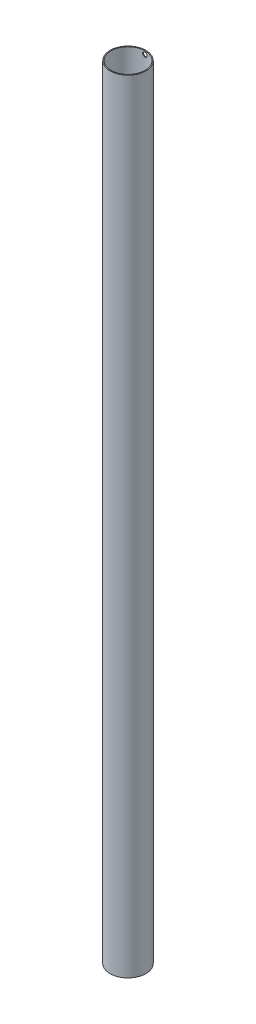
ISO-10303-21;
HEADER;
FILE_DESCRIPTION(('STEP AP214'),'2;1');
FILE_NAME('part.step','',(''),(''),'','','');
FILE_SCHEMA(('AUTOMOTIVE_DESIGN { 1 0 10303 214 1 1 1 1 }'));
ENDSEC;
DATA;
#1=APPLICATION_CONTEXT('core data for automotive mechanical design processes');
#2=APPLICATION_PROTOCOL_DEFINITION('international standard','automotive_design',2000,#1);
#3=PRODUCT_CONTEXT('',#1,'mechanical');
#4=PRODUCT('Part','Part','',(#3));
#5=PRODUCT_RELATED_PRODUCT_CATEGORY('part','',(#4));
#6=PRODUCT_DEFINITION_FORMATION('','',#4);
#7=PRODUCT_DEFINITION_CONTEXT('part definition',#1,'design');
#8=PRODUCT_DEFINITION('design','',#6,#7);
#9=PRODUCT_DEFINITION_SHAPE('','',#8);
#10=(LENGTH_UNIT() NAMED_UNIT(*) SI_UNIT(.MILLI.,.METRE.));
#11=(NAMED_UNIT(*) PLANE_ANGLE_UNIT() SI_UNIT($,.RADIAN.));
#12=(NAMED_UNIT(*) SI_UNIT($,.STERADIAN.) SOLID_ANGLE_UNIT());
#13=UNCERTAINTY_MEASURE_WITH_UNIT(LENGTH_MEASURE(1.E-05),#10,'distance_accuracy_value','');
#14=(GEOMETRIC_REPRESENTATION_CONTEXT(3) GLOBAL_UNCERTAINTY_ASSIGNED_CONTEXT((#13)) GLOBAL_UNIT_ASSIGNED_CONTEXT((#10,
#11,#12)) REPRESENTATION_CONTEXT('',''));
#15=CARTESIAN_POINT('',(0.,0.,0.));
#16=DIRECTION('',(0.,0.,1.));
#17=DIRECTION('',(1.,0.,0.));
#18=AXIS2_PLACEMENT_3D('',#15,#16,#17);
#19=CARTESIAN_POINT('',(0.,1750.,0.));
#20=DIRECTION('',(0.,1.,0.));
#21=DIRECTION('',(0.,0.,1.));
#22=AXIS2_PLACEMENT_3D('',#19,#20,#21);
#23=PLANE('',#22);
#24=CARTESIAN_POINT('',(0.,1750.,0.));
#25=DIRECTION('',(0.,1.,0.));
#26=DIRECTION('',(0.,0.,1.));
#27=AXIS2_PLACEMENT_3D('',#24,#25,#26);
#28=CIRCLE('',#27,40.);
#29=CARTESIAN_POINT('',(0.,1750.,40.));
#30=VERTEX_POINT('',#29);
#31=EDGE_CURVE('E10',#30,#30,#28,.T.);
#32=ORIENTED_EDGE('',*,*,#31,.T.);
#33=EDGE_LOOP('',(#32));
#34=FACE_BOUND('',#33,.T.);
#35=CARTESIAN_POINT('',(0.,1750.,0.));
#36=DIRECTION('',(0.,1.,0.));
#37=DIRECTION('',(0.,0.,1.));
#38=AXIS2_PLACEMENT_3D('',#35,#36,#37);
#39=CIRCLE('',#38,38.);
#40=CARTESIAN_POINT('',(0.,1750.,38.));
#41=VERTEX_POINT('',#40);
#42=EDGE_CURVE('E49',#41,#41,#39,.T.);
#43=ORIENTED_EDGE('',*,*,#42,.F.);
#44=EDGE_LOOP('',(#43));
#45=FACE_BOUND('',#44,.T.);
#46=ADVANCED_FACE('F31',(#34,#45),#23,.T.);
#47=CARTESIAN_POINT('',(0.,0.,0.));
#48=DIRECTION('',(0.,1.,0.));
#49=DIRECTION('',(0.,0.,1.));
#50=AXIS2_PLACEMENT_3D('',#47,#48,#49);
#51=PLANE('',#50);
#52=CARTESIAN_POINT('',(0.,0.,0.));
#53=DIRECTION('',(0.,1.,0.));
#54=DIRECTION('',(0.,0.,1.));
#55=AXIS2_PLACEMENT_3D('',#52,#53,#54);
#56=CIRCLE('',#55,40.);
#57=CARTESIAN_POINT('',(0.,0.,40.));
#58=VERTEX_POINT('',#57);
#59=EDGE_CURVE('E44',#58,#58,#56,.T.);
#60=ORIENTED_EDGE('',*,*,#59,.F.);
#61=EDGE_LOOP('',(#60));
#62=FACE_BOUND('',#61,.T.);
#63=CARTESIAN_POINT('',(0.,0.,0.));
#64=DIRECTION('',(0.,1.,0.));
#65=DIRECTION('',(0.,0.,1.));
#66=AXIS2_PLACEMENT_3D('',#63,#64,#65);
#67=CIRCLE('',#66,38.);
#68=CARTESIAN_POINT('',(0.,0.,38.));
#69=VERTEX_POINT('',#68);
#70=EDGE_CURVE('E51',#69,#69,#67,.T.);
#71=ORIENTED_EDGE('',*,*,#70,.T.);
#72=EDGE_LOOP('',(#71));
#73=FACE_BOUND('',#72,.T.);
#74=ADVANCED_FACE('F71',(#62,#73),#51,.F.);
#75=CARTESIAN_POINT('',(0.,1750.,0.));
#76=DIRECTION('',(0.,-1.,0.));
#77=DIRECTION('',(0.,0.,-1.));
#78=AXIS2_PLACEMENT_3D('',#75,#76,#77);
#79=CYLINDRICAL_SURFACE('',#78,40.);
#80=CARTESIAN_POINT('',(0.,1747.5,-40.));
#81=CARTESIAN_POINT('',(-0.139890119905133,1747.50000160544,-40.0000005381638));
#82=CARTESIAN_POINT('',(-0.279756672055427,1747.49412713053,-39.9992647084955));
#83=CARTESIAN_POINT('',(-0.558534146473246,1747.47067434773,-39.9963430990474));
#84=CARTESIAN_POINT('',(-0.697444844924129,1747.45309338704,-39.9941569906199));
#85=CARTESIAN_POINT('',(-0.973374569297794,1747.40633674356,-39.9883933720996));
#86=CARTESIAN_POINT('',(-1.11039210784,1747.37715242705,-39.984814825974));
#87=CARTESIAN_POINT('',(-1.3815095487987,1747.30739331014,-39.9763659190365));
#88=CARTESIAN_POINT('',(-1.51560836311208,1747.26681433761,-39.9714950850908));
#89=CARTESIAN_POINT('',(-1.77974867952934,1747.17461680295,-39.9606049872555));
#90=CARTESIAN_POINT('',(-1.90979428479132,1747.12300985009,-39.954586931772));
#91=CARTESIAN_POINT('',(-2.16511159371563,1747.00908421885,-39.9415653040234));
#92=CARTESIAN_POINT('',(-2.29038151829063,1746.94676159529,-39.9345613689602));
#93=CARTESIAN_POINT('',(-2.535157466937,1746.81190117409,-39.9197695937799));
#94=CARTESIAN_POINT('',(-2.65466661068786,1746.73936899069,-39.9119821851605));
#95=CARTESIAN_POINT('',(-2.88721115185143,1746.58454780778,-39.8958344174102));
#96=CARTESIAN_POINT('',(-3.00024412947128,1746.50225519615,-39.8874738466497));
#97=CARTESIAN_POINT('',(-3.21950680684037,1746.328115082,-39.870376541653));
#98=CARTESIAN_POINT('',(-3.32570323025805,1746.23622582935,-39.8616382696722));
#99=CARTESIAN_POINT('',(-3.53002741979655,1746.04381244367,-39.8440638930874));
#100=CARTESIAN_POINT('',(-3.62815218732704,1745.94328512973,-39.8352277534966));
#101=CARTESIAN_POINT('',(-3.81557488779224,1745.73435870872,-39.8177127277211));
#102=CARTESIAN_POINT('',(-3.9048756071177,1745.62596210543,-39.8090337926071));
#103=CARTESIAN_POINT('',(-4.07409000497663,1745.40198180306,-39.7920724042628));
#104=CARTESIAN_POINT('',(-4.15400020829436,1745.28639546727,-39.7837900984836));
#105=CARTESIAN_POINT('',(-4.30405460761979,1745.04851867461,-39.767836590115));
#106=CARTESIAN_POINT('',(-4.37416871629255,1744.92620910453,-39.7601672998988));
#107=CARTESIAN_POINT('',(-4.50386359810229,1744.6760232049,-39.7456849515384));
#108=CARTESIAN_POINT('',(-4.56344045265632,1744.54814482636,-39.7388722121988));
#109=CARTESIAN_POINT('',(-4.67157237881492,1744.28780851208,-39.7263059358327));
#110=CARTESIAN_POINT('',(-4.72013184632192,1744.15535242722,-39.7205519765303));
#111=CARTESIAN_POINT('',(-4.80591459607026,1743.88675855093,-39.7102634489657));
#112=CARTESIAN_POINT('',(-4.8431337151316,1743.75061942733,-39.7057293285926));
#113=CARTESIAN_POINT('',(-4.93694468367959,1743.3396702752,-39.6942156965831));
#114=CARTESIAN_POINT('',(-4.97637915708477,1743.06066399024,-39.689242054193));
#115=CARTESIAN_POINT('',(-5.00788537091911,1742.50010496912,-39.6852781774936));
#116=CARTESIAN_POINT('',(-4.99995901599062,1742.21855233582,-39.6862877025679));
#117=CARTESIAN_POINT('',(-4.9372306806791,1741.66240163939,-39.6941397412189));
#118=CARTESIAN_POINT('',(-4.88269650974369,1741.3877730541,-39.7009489290566));
#119=CARTESIAN_POINT('',(-4.7287017826105,1740.851606931,-39.7195838252991));
#120=CARTESIAN_POINT('',(-4.62924031615999,1740.59006965855,-39.7314096353432));
#121=CARTESIAN_POINT('',(-4.38793084641348,1740.08666481622,-39.7587823629902));
#122=CARTESIAN_POINT('',(-4.24596643413685,1739.84485361774,-39.7743394764765));
#123=CARTESIAN_POINT('',(-3.92376301219546,1739.38838639293,-39.8074142163638));
#124=CARTESIAN_POINT('',(-3.74352225186021,1739.17373160939,-39.8249319324209));
#125=CARTESIAN_POINT('',(-3.34839820167261,1738.77611463762,-39.8601022011236));
#126=CARTESIAN_POINT('',(-3.13328401036461,1738.59338183229,-39.8777548486259));
#127=CARTESIAN_POINT('',(-2.67531434354312,1738.26658222412,-39.911092650229));
#128=CARTESIAN_POINT('',(-2.43245880406289,1738.12251551044,-39.9267777997928));
#129=CARTESIAN_POINT('',(-1.92572334129984,1737.87713736329,-39.954423044609));
#130=CARTESIAN_POINT('',(-1.66183639028533,1737.77584029329,-39.9663818880919));
#131=CARTESIAN_POINT('',(-1.120615881252,1737.6190590119,-39.9852157155401));
#132=CARTESIAN_POINT('',(-0.843282953394262,1737.56357265574,-39.9920909375101));
#133=CARTESIAN_POINT('',(-0.28502632769475,1737.50028515146,-39.9999519282224));
#134=CARTESIAN_POINT('',(-0.00413898025510944,1737.49216801417,-40.0009767228211));
#135=CARTESIAN_POINT('',(0.554992072853036,1737.52301546921,-39.9971267601402));
#136=CARTESIAN_POINT('',(0.833235834693541,1737.5619790589,-39.9922521284979));
#137=CARTESIAN_POINT('',(1.37824901587756,1737.68561941317,-39.9771753750007));
#138=CARTESIAN_POINT('',(1.64505314244345,1737.77014551042,-39.9669908157769));
#139=CARTESIAN_POINT('',(2.16069930812288,1737.98235492022,-39.9424344625044));
#140=CARTESIAN_POINT('',(2.40954073698902,1738.11003969816,-39.9280625262813));
#141=CARTESIAN_POINT('',(2.88360904734714,1738.40570621352,-39.8966364563238));
#142=CARTESIAN_POINT('',(3.10870754222787,1738.57389234956,-39.8795688738227));
#143=CARTESIAN_POINT('',(3.52759395691152,1738.94549922513,-39.8447028535409));
#144=CARTESIAN_POINT('',(3.72138063328024,1739.14892136328,-39.8269043867709));
#145=CARTESIAN_POINT('',(4.07326400150423,1739.58661396985,-39.7924620828694));
#146=CARTESIAN_POINT('',(4.23115123496741,1739.82105346081,-39.775825395705));
#147=CARTESIAN_POINT('',(4.5053054650617,1740.31331972146,-39.7457083194625));
#148=CARTESIAN_POINT('',(4.62157329603301,1740.57114602218,-39.7322278671136));
#149=CARTESIAN_POINT('',(4.80885432607941,1741.10213860676,-39.7099966403349));
#150=CARTESIAN_POINT('',(4.87998560998225,1741.37526281197,-39.7012335337283));
#151=CARTESIAN_POINT('',(4.97533563287034,1741.9298498136,-39.6893996880528));
#152=CARTESIAN_POINT('',(4.99955655425281,1742.2113122215,-39.686328684172));
#153=CARTESIAN_POINT('',(5.00021203982538,1742.63229490032,-39.686241386048));
#154=CARTESIAN_POINT('',(4.9945534244889,1742.77200922555,-39.68695676783));
#155=CARTESIAN_POINT('',(4.97156759842694,1743.05044550454,-39.6898435691377));
#156=CARTESIAN_POINT('',(4.9542447344073,1743.18916780852,-39.6920144462689));
#157=CARTESIAN_POINT('',(4.90804527126815,1743.46468703838,-39.6977533828976));
#158=CARTESIAN_POINT('',(4.87916447008385,1743.60148324525,-39.7013219505368));
#159=CARTESIAN_POINT('',(4.81007786270752,1743.87209372374,-39.7097514776595));
#160=CARTESIAN_POINT('',(4.76987617588936,1744.00590906095,-39.7146119670106));
#161=CARTESIAN_POINT('',(4.67843682035615,1744.26966440411,-39.7254873627674));
#162=CARTESIAN_POINT('',(4.62719918212904,1744.39960442077,-39.731502265984));
#163=CARTESIAN_POINT('',(4.51407883701018,1744.65465706308,-39.7445132115212));
#164=CARTESIAN_POINT('',(4.45219999438851,1744.77977142101,-39.7515088975085));
#165=CARTESIAN_POINT('',(4.31820085845317,1745.02440060789,-39.766288286481));
#166=CARTESIAN_POINT('',(4.24607681362526,1745.14391336428,-39.7740722778211));
#167=CARTESIAN_POINT('',(4.09214062508206,1745.37642448291,-39.7902044420044));
#168=CARTESIAN_POINT('',(4.01033196639711,1745.4894251669,-39.7985524114375));
#169=CARTESIAN_POINT('',(3.83696646630918,1745.70895432041,-39.8156417227916));
#170=CARTESIAN_POINT('',(3.74534501263967,1745.81543158787,-39.8243854215878));
#171=CARTESIAN_POINT('',(3.55351080059102,1746.02026178004,-39.8419606965952));
#172=CARTESIAN_POINT('',(3.45330116889794,1746.1186176361,-39.8507922397986));
#173=CARTESIAN_POINT('',(3.24489676777323,1746.3066193573,-39.8683029909287));
#174=CARTESIAN_POINT('',(3.13669721323733,1746.39625992724,-39.8769821036513));
#175=CARTESIAN_POINT('',(2.91316118457674,1746.56610237103,-39.8939349862932));
#176=CARTESIAN_POINT('',(2.79782736151186,1746.64630771919,-39.9022089047575));
#177=CARTESIAN_POINT('',(2.56029300186387,1746.79706521534,-39.9181553288822));
#178=CARTESIAN_POINT('',(2.43806574742498,1746.86757555883,-39.925825172646));
#179=CARTESIAN_POINT('',(2.18809688735176,1746.99801067552,-39.9403041894309));
#180=CARTESIAN_POINT('',(2.06035732624471,1747.05793933221,-39.9471136779408));
#181=CARTESIAN_POINT('',(1.80032528471162,1747.16676281986,-39.9596765836336));
#182=CARTESIAN_POINT('',(1.66803644956573,1747.21566625823,-39.9654308239915));
#183=CARTESIAN_POINT('',(1.39980201837414,1747.30212587716,-39.9757248289655));
#184=CARTESIAN_POINT('',(1.26385729314409,1747.33968473433,-39.9802648800246));
#185=CARTESIAN_POINT('',(0.942088347754073,1747.41409048578,-39.9893293227844));
#186=CARTESIAN_POINT('',(0.75515089775798,1747.44627339192,-39.993314089932));
#187=CARTESIAN_POINT('',(0.378794555992385,1747.4892269834,-39.9986490545576));
#188=CARTESIAN_POINT('',(0.189375682531509,1747.49999782664,-39.999999271463));
#189=CARTESIAN_POINT('',(0.,1747.5,-40.));
#190=B_SPLINE_CURVE_WITH_KNOTS('',3,(#80,#81,#82,#83,#84,#85,#86,#87,#88,#89,#90,#91,#92,#93,
#94,#95,#96,#97,#98,#99,#100,#101,#102,#103,#104,#105,#106,#107,#108,#109,#110,#111,#112,#113,
#114,#115,#116,#117,#118,#119,#120,#121,#122,#123,#124,#125,#126,#127,#128,#129,#130,#131,#132,
#133,#134,#135,#136,#137,#138,#139,#140,#141,#142,#143,#144,#145,#146,#147,#148,#149,#150,#151,
#152,#153,#154,#155,#156,#157,#158,#159,#160,#161,#162,#163,#164,#165,#166,#167,#168,#169,#170,
#171,#172,#173,#174,#175,#176,#177,#178,#179,#180,#181,#182,#183,#184,#185,#186,#187,#188,#189),
.UNSPECIFIED.,.T.,.F.,(4,2,2,2,2,2,2,2,2,2,2,2,2,2,2,2,2,2,2,2,2,2,2,2,2,2,2,2,2,2,2,2,2,2,2,2,
2,2,2,2,2,2,2,2,2,2,2,2,2,2,2,2,2,2,4),(0.,0.41950463782401,0.839104372080601,1.2590169051986,
1.6790833898206,2.09870982539674,2.51849108679862,2.93804240646991,3.35774948092477,
3.77936522319634,4.2011368933698,4.62277495120624,5.04456855951603,5.46763043530075,
5.89084930960155,6.31389902278669,6.73710385606694,7.57817257185709,8.41920746382375,
9.25544199496442,10.0916934694555,10.9302565918415,11.7688580764037,12.6132576288592,
13.4576591283931,14.3023439807631,15.1469892842065,15.9859936539693,16.8249801561694,
17.6612091439987,18.4974665277097,19.3380361246992,20.1786390936325,21.0240274962821,
21.8693989505617,22.7125495517494,23.5556609263434,23.9747450940194,24.3936731755016,
24.812753703262,25.2316819351986,25.6506090098182,26.0693842743661,26.4883132802116,
26.9070919891522,27.3288208308202,27.7503967812446,28.1722272905916,28.5939019805888,
29.0173414250532,29.4406251425126,29.8635772481612,30.2864294856976,30.8543363757694,
31.4222390780256),.UNSPECIFIED.);
#191=CARTESIAN_POINT('',(0.,1747.5,-40.));
#192=VERTEX_POINT('',#191);
#193=EDGE_CURVE('E54',#192,#192,#190,.T.);
#194=ORIENTED_EDGE('',*,*,#193,.T.);
#195=EDGE_LOOP('',(#194));
#196=FACE_BOUND('',#195,.T.);
#197=ORIENTED_EDGE('',*,*,#31,.F.);
#198=EDGE_LOOP('',(#197));
#199=FACE_BOUND('',#198,.T.);
#200=ORIENTED_EDGE('',*,*,#59,.T.);
#201=EDGE_LOOP('',(#200));
#202=FACE_BOUND('',#201,.T.);
#203=ADVANCED_FACE('F33',(#196,#199,#202),#79,.T.);
#204=CARTESIAN_POINT('',(0.,1750.,0.));
#205=DIRECTION('',(0.,-1.,0.));
#206=DIRECTION('',(0.,0.,-1.));
#207=AXIS2_PLACEMENT_3D('',#204,#205,#206);
#208=CYLINDRICAL_SURFACE('',#207,38.);
#209=CARTESIAN_POINT('',(0.,1747.5,-38.));
#210=CARTESIAN_POINT('',(-0.139827173805465,1747.50000167664,-38.0000005893026));
#211=CARTESIAN_POINT('',(-0.279630016313879,1747.49413245128,-37.9992267173652));
#212=CARTESIAN_POINT('',(-0.558279630526736,1747.47070108578,-37.9961541121181));
#213=CARTESIAN_POINT('',(-0.697126182359507,1747.45313634168,-37.9938550392284));
#214=CARTESIAN_POINT('',(-0.972924997236437,1747.4064239463,-37.9877935944839));
#215=CARTESIAN_POINT('',(-1.10987580424902,1747.37726785321,-37.9840301561964));
#216=CARTESIAN_POINT('',(-1.38086014256225,1747.3075777545,-37.9751446316185));
#217=CARTESIAN_POINT('',(-1.51489258562322,1747.2670395803,-37.9700220475914));
#218=CARTESIAN_POINT('',(-1.77889894378765,1747.17493782817,-37.9585689927767));
#219=CARTESIAN_POINT('',(-1.90887704354739,1747.12338608052,-37.9522398188338));
#220=CARTESIAN_POINT('',(-2.16406291646772,1747.00958496316,-37.9385446025055));
#221=CARTESIAN_POINT('',(-2.28926891172171,1746.94733165313,-37.9311781783862));
#222=CARTESIAN_POINT('',(-2.53392399395277,1746.81262326685,-37.9156201073643));
#223=CARTESIAN_POINT('',(-2.65337615566702,1746.74017372231,-37.9074289086031));
#224=CARTESIAN_POINT('',(-2.88581550274296,1746.58553079888,-37.8904428014647));
#225=CARTESIAN_POINT('',(-2.99880027008965,1746.50333381047,-37.881647669959));
#226=CARTESIAN_POINT('',(-3.21803398665954,1746.32935233936,-37.8636556310254));
#227=CARTESIAN_POINT('',(-3.32424596833086,1746.23752145793,-37.8544569161359));
#228=CARTESIAN_POINT('',(-3.52860722654728,1746.04522548895,-37.8359546502843));
#229=CARTESIAN_POINT('',(-3.62675350623373,1745.94475722024,-37.8266510618027));
#230=CARTESIAN_POINT('',(-3.81422663813821,1745.73594742023,-37.8082074001644));
#231=CARTESIAN_POINT('',(-3.90355625998728,1745.62760838011,-37.7990672764009));
#232=CARTESIAN_POINT('',(-4.07283640194845,1745.40373973665,-37.7812023718806));
#233=CARTESIAN_POINT('',(-4.15278344996801,1745.28820749548,-37.7724777455869));
#234=CARTESIAN_POINT('',(-4.3029481602993,1745.0503881206,-37.7556666975462));
#235=CARTESIAN_POINT('',(-4.37313195013267,1744.92807943233,-37.7475825376149));
#236=CARTESIAN_POINT('',(-4.50296535964819,1744.67788371913,-37.7323147632565));
#237=CARTESIAN_POINT('',(-4.56261105820435,1744.54999463976,-37.7251314843262));
#238=CARTESIAN_POINT('',(-4.67087786610236,1744.2896254322,-37.7118798720486));
#239=CARTESIAN_POINT('',(-4.71950340775972,1744.15714717459,-37.7058110906366));
#240=CARTESIAN_POINT('',(-4.80541377180915,1743.88849770759,-37.6949578225796));
#241=CARTESIAN_POINT('',(-4.84269443263189,1743.75232516295,-37.6901738072924));
#242=CARTESIAN_POINT('',(-4.93664447396984,1743.3414142654,-37.6780272917609));
#243=CARTESIAN_POINT('',(-4.97617270941504,1743.06247079926,-37.6727752187155));
#244=CARTESIAN_POINT('',(-5.00788229226824,1742.50201632495,-37.6685722997963));
#245=CARTESIAN_POINT('',(-5.00006574277392,1742.22050543137,-37.6696211740287));
#246=CARTESIAN_POINT('',(-4.9375909584646,1741.66460309123,-37.6778604000332));
#247=CARTESIAN_POINT('',(-4.88322993513618,1741.39017782884,-37.6850117830345));
#248=CARTESIAN_POINT('',(-4.72965675506353,1740.85438944971,-37.7045923385047));
#249=CARTESIAN_POINT('',(-4.63044360019046,1740.59302662379,-37.7170216284264));
#250=CARTESIAN_POINT('',(-4.38966990811322,1740.08985014382,-37.7458006881754));
#251=CARTESIAN_POINT('',(-4.24798098799493,1739.84809862018,-37.7621623133203));
#252=CARTESIAN_POINT('',(-3.92636834211414,1739.39169191918,-37.7969537024261));
#253=CARTESIAN_POINT('',(-3.74644267979293,1739.1770381151,-37.8153835711141));
#254=CARTESIAN_POINT('',(-3.35182053722462,1738.77919415728,-37.8524078607452));
#255=CARTESIAN_POINT('',(-3.13686796025035,1738.59625794608,-37.8710024596344));
#256=CARTESIAN_POINT('',(-2.67917318315239,1738.26902230348,-37.9061290870926));
#257=CARTESIAN_POINT('',(-2.43643090658588,1738.12472297838,-37.9226611099877));
#258=CARTESIAN_POINT('',(-1.92984551315677,1737.87885383047,-37.9518117394229));
#259=CARTESIAN_POINT('',(-1.66599414487115,1737.77730081503,-37.9644288061348));
#260=CARTESIAN_POINT('',(-1.12478066285468,1737.62001331207,-37.9843142775397));
#261=CARTESIAN_POINT('',(-0.847419251231571,1737.56427644621,-37.991582959869));
#262=CARTESIAN_POINT('',(-0.289253683058114,1737.50053463065,-37.9999164272303));
#263=CARTESIAN_POINT('',(-0.0084901078173431,1737.49218003491,-38.0010266557481));
#264=CARTESIAN_POINT('',(0.550433330392632,1737.52251588641,-37.9970410666863));
#265=CARTESIAN_POINT('',(0.828593254792765,1737.56120522085,-37.9919453959034));
#266=CARTESIAN_POINT('',(1.37337501872894,1737.68424011369,-37.9761488039321));
#267=CARTESIAN_POINT('',(1.64003535958208,1737.76841806149,-37.9654684650592));
#268=CARTESIAN_POINT('',(2.15545537965893,1737.97986587883,-37.9396976968612));
#269=CARTESIAN_POINT('',(2.40421439151408,1738.10713735391,-37.9246071032261));
#270=CARTESIAN_POINT('',(2.87832607700339,1738.40199880811,-37.8915835745992));
#271=CARTESIAN_POINT('',(3.10353764526371,1738.56981388556,-37.8736349685475));
#272=CARTESIAN_POINT('',(3.52272363700334,1738.94068269835,-37.8369499021587));
#273=CARTESIAN_POINT('',(3.71669668027535,1739.14373798988,-37.8182134070565));
#274=CARTESIAN_POINT('',(4.06914818554975,1739.58086378683,-37.7819229822575));
#275=CARTESIAN_POINT('',(4.2273942178392,1739.81512246491,-37.7643772880799));
#276=CARTESIAN_POINT('',(4.50229017676511,1740.30711058989,-37.7325935813094));
#277=CARTESIAN_POINT('',(4.61894101206686,1740.56483952392,-37.7183554964625));
#278=CARTESIAN_POINT('',(4.80696796654004,1741.09566346201,-37.6948544852316));
#279=CARTESIAN_POINT('',(4.87847296497428,1741.36871227969,-37.6855774082079));
#280=CARTESIAN_POINT('',(4.97457363010994,1741.92322659482,-37.6730151539828));
#281=CARTESIAN_POINT('',(4.99917173505585,1742.20469165402,-37.6697296653359));
#282=CARTESIAN_POINT('',(5.00038176018792,1742.62561777222,-37.669564080716));
#283=CARTESIAN_POINT('',(4.99491445651593,1742.76524947141,-37.670292361017));
#284=CARTESIAN_POINT('',(4.97232515631454,1743.04353636364,-37.6732815818125));
#285=CARTESIAN_POINT('',(4.95520750616166,1743.18219190136,-37.6755419507316));
#286=CARTESIAN_POINT('',(4.9094315430938,1743.45759358416,-37.6815340047253));
#287=CARTESIAN_POINT('',(4.8807690429303,1743.59433901782,-37.6852662236207));
#288=CARTESIAN_POINT('',(4.81213126355231,1743.864864848,-37.694092248381));
#289=CARTESIAN_POINT('',(4.77216009295074,1743.99864630237,-37.699185559703));
#290=CARTESIAN_POINT('',(4.68119726346453,1744.26234046421,-37.7105885726492));
#291=CARTESIAN_POINT('',(4.6302065846919,1744.39225351457,-37.7168981660879));
#292=CARTESIAN_POINT('',(4.51759240818444,1744.6472728919,-37.7305522453723));
#293=CARTESIAN_POINT('',(4.4559727629252,1744.77238094042,-37.7378963560804));
#294=CARTESIAN_POINT('',(4.3225026043145,1745.01702092511,-37.753416855033));
#295=CARTESIAN_POINT('',(4.25064830507753,1745.13655077604,-37.7615935509374));
#296=CARTESIAN_POINT('',(4.09725980949826,1745.36912176353,-37.7785443236699));
#297=CARTESIAN_POINT('',(4.01572908421857,1745.48216520539,-37.7873181858077));
#298=CARTESIAN_POINT('',(3.84286410538492,1745.70188801618,-37.8052906690916));
#299=CARTESIAN_POINT('',(3.7514585930902,1745.8085111043,-37.8144920611676));
#300=CARTESIAN_POINT('',(3.56004562076108,1746.01365175899,-37.8329924055036));
#301=CARTESIAN_POINT('',(3.46004128490217,1746.11217224422,-37.8422913212616));
#302=CARTESIAN_POINT('',(3.25203426117363,1746.3005223988,-37.860733993901));
#303=CARTESIAN_POINT('',(3.14402678963051,1746.39034679508,-37.8698776539031));
#304=CARTESIAN_POINT('',(2.92085825384995,1746.56057575591,-37.8877435430019));
#305=CARTESIAN_POINT('',(2.8056998468709,1746.64098378787,-37.8964659265265));
#306=CARTESIAN_POINT('',(2.56844918034762,1746.79219607755,-37.913286233068));
#307=CARTESIAN_POINT('',(2.44632751443664,1746.86295454908,-37.9213811053095));
#308=CARTESIAN_POINT('',(2.19654300832747,1746.99389327116,-37.9366689178239));
#309=CARTESIAN_POINT('',(2.0688822235266,1747.05407740437,-37.9438621888649));
#310=CARTESIAN_POINT('',(1.80897816432049,1747.16341676862,-37.9571404325894));
#311=CARTESIAN_POINT('',(1.67673850157943,1747.21258047329,-37.9632262561096));
#312=CARTESIAN_POINT('',(1.40857438553234,1747.29956147194,-37.974121896062));
#313=CARTESIAN_POINT('',(1.27265079863292,1747.33738140898,-37.9789320097015));
#314=CARTESIAN_POINT('',(0.949506875428191,1747.41272031554,-37.9885896005996));
#315=CARTESIAN_POINT('',(0.76112357122173,1747.44541581682,-37.992850321283));
#316=CARTESIAN_POINT('',(0.381811715662992,1747.4890544222,-37.9985551067751));
#317=CARTESIAN_POINT('',(0.190883185955593,1747.49999771115,-37.9999991955215));
#318=CARTESIAN_POINT('',(0.,1747.5,-38.));
#319=B_SPLINE_CURVE_WITH_KNOTS('',3,(#209,#210,#211,#212,#213,#214,#215,#216,#217,#218,#219,
#220,#221,#222,#223,#224,#225,#226,#227,#228,#229,#230,#231,#232,#233,#234,#235,#236,#237,#238,
#239,#240,#241,#242,#243,#244,#245,#246,#247,#248,#249,#250,#251,#252,#253,#254,#255,#256,#257,
#258,#259,#260,#261,#262,#263,#264,#265,#266,#267,#268,#269,#270,#271,#272,#273,#274,#275,#276,
#277,#278,#279,#280,#281,#282,#283,#284,#285,#286,#287,#288,#289,#290,#291,#292,#293,#294,#295,
#296,#297,#298,#299,#300,#301,#302,#303,#304,#305,#306,#307,#308,#309,#310,#311,#312,#313,#314,
#315,#316,#317,#318),.UNSPECIFIED.,.T.,.F.,(4,2,2,2,2,2,2,2,2,2,2,2,2,2,2,2,2,2,2,2,2,2,2,2,2,2,
2,2,2,2,2,2,2,2,2,2,2,2,2,2,2,2,2,2,2,2,2,2,2,2,2,2,2,2,4),(0.,0.419314443962592,
0.838722277957316,1.25843612155173,1.67830388242657,2.09772288737555,2.51729665432953,
2.93664366360749,3.356146446889,3.77777146144795,4.19955243154998,4.62120048044613,
5.043004074651,5.4662363962693,5.88962586855892,6.31284474987411,6.73621869121596,
7.57715127184435,8.41804649776945,9.25361186297241,10.0891958235673,10.9273312444294,
11.765509124072,12.6101155500403,13.4547242993747,14.2996648298523,15.1445614960994,
15.9832152570338,16.821849180514,17.6574138763295,18.4930097062046,19.3333559188387,
20.1737392501892,21.0194416926611,21.8651256592607,22.7083843771602,23.5515992608419,
23.9704133032086,24.3890711848602,24.8078810481663,25.2265389464122,25.6451596231352,
26.0636288881332,26.4822533524263,26.900728101863,27.3224547713167,27.7440288588021,
28.1658569965094,28.5875293118969,29.0111375446697,29.4345899116562,29.8577155596098,
30.2807425434772,30.8531688826801,31.4255903570076),.UNSPECIFIED.);
#320=CARTESIAN_POINT('',(0.,1747.5,-38.));
#321=VERTEX_POINT('',#320);
#322=EDGE_CURVE('E36',#321,#321,#319,.T.);
#323=ORIENTED_EDGE('',*,*,#322,.F.);
#324=EDGE_LOOP('',(#323));
#325=FACE_BOUND('',#324,.T.);
#326=ORIENTED_EDGE('',*,*,#42,.T.);
#327=EDGE_LOOP('',(#326));
#328=FACE_BOUND('',#327,.T.);
#329=ORIENTED_EDGE('',*,*,#70,.F.);
#330=EDGE_LOOP('',(#329));
#331=FACE_BOUND('',#330,.T.);
#332=ADVANCED_FACE('F63',(#325,#328,#331),#208,.F.);
#333=CARTESIAN_POINT('',(0.,1742.5,-40.));
#334=DIRECTION('',(0.,0.,1.));
#335=DIRECTION('',(1.,0.,0.));
#336=AXIS2_PLACEMENT_3D('',#333,#334,#335);
#337=CYLINDRICAL_SURFACE('',#336,5.00000000000001);
#338=ORIENTED_EDGE('',*,*,#322,.T.);
#339=EDGE_LOOP('',(#338));
#340=FACE_BOUND('',#339,.T.);
#341=ORIENTED_EDGE('',*,*,#193,.F.);
#342=EDGE_LOOP('',(#341));
#343=FACE_BOUND('',#342,.T.);
#344=ADVANCED_FACE('F60',(#340,#343),#337,.F.);
#345=CLOSED_SHELL('',(#46,#74,#203,#332,#344));
#346=MANIFOLD_SOLID_BREP('B2',#345);
#347=ADVANCED_BREP_SHAPE_REPRESENTATION('',(#18,#346),#14);
#348=SHAPE_DEFINITION_REPRESENTATION(#9,#347);
ENDSEC;
END-ISO-10303-21;
